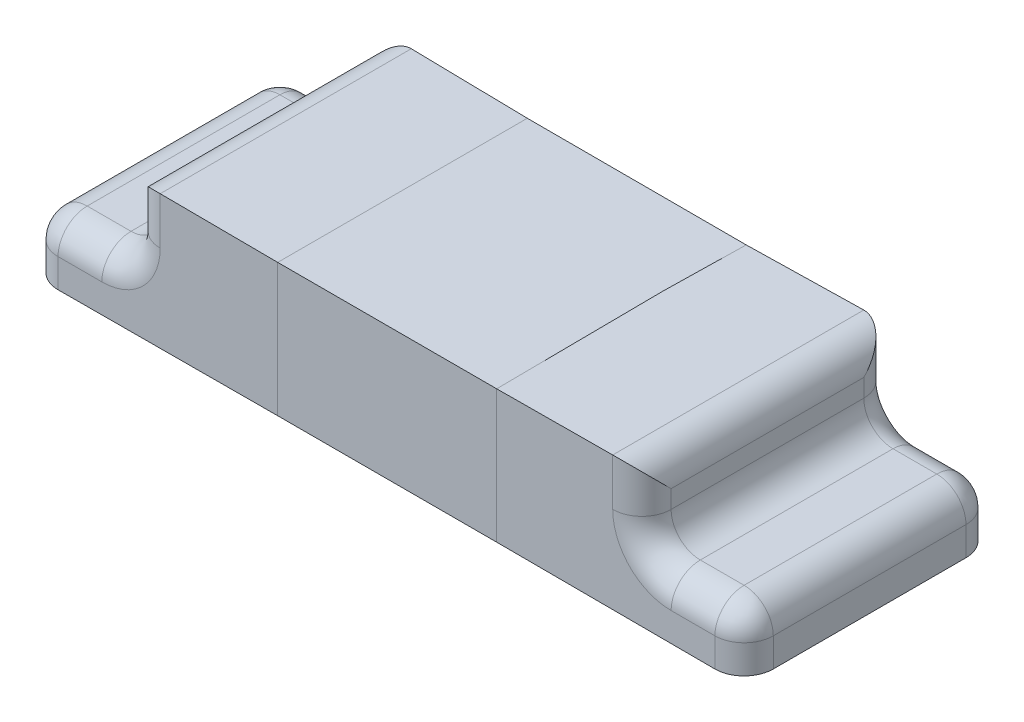
ISO-10303-21;
HEADER;
FILE_DESCRIPTION(('STEP AP214'),'2;1');
FILE_NAME('part.step','',(''),(''),'','','');
FILE_SCHEMA(('AUTOMOTIVE_DESIGN { 1 0 10303 214 1 1 1 1 }'));
ENDSEC;
DATA;
#1=APPLICATION_CONTEXT('core data for automotive mechanical design processes');
#2=APPLICATION_PROTOCOL_DEFINITION('international standard','automotive_design',2000,#1);
#3=PRODUCT_CONTEXT('',#1,'mechanical');
#4=PRODUCT('Part','Part','',(#3));
#5=PRODUCT_RELATED_PRODUCT_CATEGORY('part','',(#4));
#6=PRODUCT_DEFINITION_FORMATION('','',#4);
#7=PRODUCT_DEFINITION_CONTEXT('part definition',#1,'design');
#8=PRODUCT_DEFINITION('design','',#6,#7);
#9=PRODUCT_DEFINITION_SHAPE('','',#8);
#10=(LENGTH_UNIT() NAMED_UNIT(*) SI_UNIT(.MILLI.,.METRE.));
#11=(NAMED_UNIT(*) PLANE_ANGLE_UNIT() SI_UNIT($,.RADIAN.));
#12=(NAMED_UNIT(*) SI_UNIT($,.STERADIAN.) SOLID_ANGLE_UNIT());
#13=UNCERTAINTY_MEASURE_WITH_UNIT(LENGTH_MEASURE(1.E-05),#10,'distance_accuracy_value','');
#14=(GEOMETRIC_REPRESENTATION_CONTEXT(3) GLOBAL_UNCERTAINTY_ASSIGNED_CONTEXT((#13)) GLOBAL_UNIT_ASSIGNED_CONTEXT((#10,
#11,#12)) REPRESENTATION_CONTEXT('',''));
#15=CARTESIAN_POINT('',(0.,0.,0.));
#16=DIRECTION('',(0.,0.,1.));
#17=DIRECTION('',(1.,0.,0.));
#18=AXIS2_PLACEMENT_3D('',#15,#16,#17);
#19=CARTESIAN_POINT('',(-1.125,0.,0.33));
#20=DIRECTION('',(0.,1.,0.));
#21=DIRECTION('',(0.,0.,1.));
#22=AXIS2_PLACEMENT_3D('',#19,#20,#21);
#23=CYLINDRICAL_SURFACE('',#22,0.1);
#24=CARTESIAN_POINT('',(-1.125,0.098442990090282,0.33));
#25=DIRECTION('',(0.,-1.,0.));
#26=DIRECTION('',(0.,0.,-1.));
#27=AXIS2_PLACEMENT_3D('',#24,#25,#26);
#28=CIRCLE('',#27,0.1);
#29=CARTESIAN_POINT('',(-1.125,0.098442990090282,0.43));
#30=VERTEX_POINT('',#29);
#31=CARTESIAN_POINT('',(-1.225,0.098442990090282,0.33));
#32=VERTEX_POINT('',#31);
#33=EDGE_CURVE('E11',#30,#32,#28,.T.);
#34=ORIENTED_EDGE('',*,*,#33,.T.);
#35=DIRECTION('',(0.,1.,0.));
#36=VECTOR('',#35,1.);
#37=CARTESIAN_POINT('',(-1.225,0.098442990090282,0.33));
#38=LINE('',#37,#36);
#39=CARTESIAN_POINT('',(-1.225,0.,0.33));
#40=VERTEX_POINT('',#39);
#41=EDGE_CURVE('E441',#40,#32,#38,.T.);
#42=ORIENTED_EDGE('',*,*,#41,.F.);
#43=CARTESIAN_POINT('',(-1.125,0.,0.33));
#44=DIRECTION('',(0.,-1.,0.));
#45=DIRECTION('',(0.,0.,1.));
#46=AXIS2_PLACEMENT_3D('',#43,#44,#45);
#47=CIRCLE('',#46,0.1);
#48=CARTESIAN_POINT('',(-1.125,0.,0.43));
#49=VERTEX_POINT('',#48);
#50=EDGE_CURVE('E654',#49,#40,#47,.T.);
#51=ORIENTED_EDGE('',*,*,#50,.F.);
#52=DIRECTION('',(0.,-1.,0.));
#53=VECTOR('',#52,1.);
#54=CARTESIAN_POINT('',(-1.125,0.,0.43));
#55=LINE('',#54,#53);
#56=EDGE_CURVE('E501',#30,#49,#55,.T.);
#57=ORIENTED_EDGE('',*,*,#56,.F.);
#58=EDGE_LOOP('',(#34,#42,#51,#57));
#59=FACE_BOUND('',#58,.T.);
#60=ADVANCED_FACE('F18',(#59),#23,.T.);
#61=CARTESIAN_POINT('',(-1.125,0.098442990090282,0.33));
#62=DIRECTION('',(0.,1.,0.));
#63=DIRECTION('',(1.,0.,0.));
#64=AXIS2_PLACEMENT_3D('',#61,#62,#63);
#65=SPHERICAL_SURFACE('',#64,0.1);
#66=CARTESIAN_POINT('',(-1.125,0.098442990090282,0.33));
#67=DIRECTION('',(1.,0.,0.));
#68=DIRECTION('',(0.,0.,-1.));
#69=AXIS2_PLACEMENT_3D('',#66,#67,#68);
#70=CIRCLE('',#69,0.1);
#71=CARTESIAN_POINT('',(-1.125,0.198442990090282,0.33));
#72=VERTEX_POINT('',#71);
#73=EDGE_CURVE('E492',#72,#30,#70,.T.);
#74=ORIENTED_EDGE('',*,*,#73,.F.);
#75=CARTESIAN_POINT('',(-1.125,0.098442990090282,0.33));
#76=DIRECTION('',(0.,0.,-1.));
#77=DIRECTION('',(-1.,0.,0.));
#78=AXIS2_PLACEMENT_3D('',#75,#76,#77);
#79=CIRCLE('',#78,0.1);
#80=EDGE_CURVE('E419',#32,#72,#79,.T.);
#81=ORIENTED_EDGE('',*,*,#80,.F.);
#82=ORIENTED_EDGE('',*,*,#33,.F.);
#83=EDGE_LOOP('',(#74,#81,#82));
#84=FACE_BOUND('',#83,.T.);
#85=ADVANCED_FACE('F339',(#84),#65,.T.);
#86=CARTESIAN_POINT('',(-1.125,0.,-0.33));
#87=DIRECTION('',(0.,-1.,0.));
#88=DIRECTION('',(0.,0.,-1.));
#89=AXIS2_PLACEMENT_3D('',#86,#87,#88);
#90=CYLINDRICAL_SURFACE('',#89,0.1);
#91=CARTESIAN_POINT('',(-1.125,0.,-0.33));
#92=DIRECTION('',(0.,-1.,0.));
#93=DIRECTION('',(0.,0.,1.));
#94=AXIS2_PLACEMENT_3D('',#91,#92,#93);
#95=CIRCLE('',#94,0.1);
#96=CARTESIAN_POINT('',(-1.225,0.,-0.33));
#97=VERTEX_POINT('',#96);
#98=CARTESIAN_POINT('',(-1.125,0.,-0.43));
#99=VERTEX_POINT('',#98);
#100=EDGE_CURVE('E273',#97,#99,#95,.T.);
#101=ORIENTED_EDGE('',*,*,#100,.F.);
#102=DIRECTION('',(0.,-1.,0.));
#103=VECTOR('',#102,1.);
#104=CARTESIAN_POINT('',(-1.225,0.,-0.33));
#105=LINE('',#104,#103);
#106=CARTESIAN_POINT('',(-1.225,0.098442990090282,-0.33));
#107=VERTEX_POINT('',#106);
#108=EDGE_CURVE('E438',#107,#97,#105,.T.);
#109=ORIENTED_EDGE('',*,*,#108,.F.);
#110=CARTESIAN_POINT('',(-1.125,0.098442990090282,-0.33));
#111=DIRECTION('',(0.,-1.,0.));
#112=DIRECTION('',(0.,0.,-1.));
#113=AXIS2_PLACEMENT_3D('',#110,#111,#112);
#114=CIRCLE('',#113,0.1);
#115=CARTESIAN_POINT('',(-1.125,0.098442990090282,-0.43));
#116=VERTEX_POINT('',#115);
#117=EDGE_CURVE('E30',#107,#116,#114,.T.);
#118=ORIENTED_EDGE('',*,*,#117,.T.);
#119=DIRECTION('',(0.,1.,0.));
#120=VECTOR('',#119,1.);
#121=CARTESIAN_POINT('',(-1.125,0.098442990090282,-0.43));
#122=LINE('',#121,#120);
#123=EDGE_CURVE('E517',#99,#116,#122,.T.);
#124=ORIENTED_EDGE('',*,*,#123,.F.);
#125=EDGE_LOOP('',(#101,#109,#118,#124));
#126=FACE_BOUND('',#125,.T.);
#127=ADVANCED_FACE('F345',(#126),#90,.T.);
#128=CARTESIAN_POINT('',(-1.125,0.098442990090282,-0.33));
#129=DIRECTION('',(0.,1.,0.));
#130=DIRECTION('',(1.,0.,0.));
#131=AXIS2_PLACEMENT_3D('',#128,#129,#130);
#132=SPHERICAL_SURFACE('',#131,0.1);
#133=CARTESIAN_POINT('',(-1.125,0.098442990090282,-0.33));
#134=DIRECTION('',(0.,0.,1.));
#135=DIRECTION('',(-1.,0.,0.));
#136=AXIS2_PLACEMENT_3D('',#133,#134,#135);
#137=CIRCLE('',#136,0.1);
#138=CARTESIAN_POINT('',(-1.125,0.198442990090282,-0.33));
#139=VERTEX_POINT('',#138);
#140=EDGE_CURVE('E424',#139,#107,#137,.T.);
#141=ORIENTED_EDGE('',*,*,#140,.F.);
#142=CARTESIAN_POINT('',(-1.125,0.098442990090282,-0.33));
#143=DIRECTION('',(1.,0.,0.));
#144=DIRECTION('',(0.,0.,-1.));
#145=AXIS2_PLACEMENT_3D('',#142,#143,#144);
#146=CIRCLE('',#145,0.1);
#147=EDGE_CURVE('E542',#116,#139,#146,.T.);
#148=ORIENTED_EDGE('',*,*,#147,.F.);
#149=ORIENTED_EDGE('',*,*,#117,.F.);
#150=EDGE_LOOP('',(#141,#148,#149));
#151=FACE_BOUND('',#150,.T.);
#152=ADVANCED_FACE('F765',(#151),#132,.T.);
#153=CARTESIAN_POINT('',(-0.775,0.,-0.33));
#154=DIRECTION('',(0.,-1.,0.));
#155=DIRECTION('',(0.,0.,-1.));
#156=AXIS2_PLACEMENT_3D('',#153,#154,#155);
#157=CYLINDRICAL_SURFACE('',#156,0.1);
#158=CARTESIAN_POINT('',(-0.775,0.298442990090282,-0.33));
#159=DIRECTION('',(0.,1.,0.));
#160=DIRECTION('',(0.,0.,-1.));
#161=AXIS2_PLACEMENT_3D('',#158,#159,#160);
#162=CIRCLE('',#161,0.1);
#163=CARTESIAN_POINT('',(-0.775,0.298442990090282,-0.43));
#164=VERTEX_POINT('',#163);
#165=CARTESIAN_POINT('',(-0.875,0.298442990090282,-0.33));
#166=VERTEX_POINT('',#165);
#167=EDGE_CURVE('E431',#164,#166,#162,.T.);
#168=ORIENTED_EDGE('',*,*,#167,.T.);
#169=DIRECTION('',(0.,-1.,0.));
#170=VECTOR('',#169,1.);
#171=CARTESIAN_POINT('',(-0.875,0.198442990090282,-0.33));
#172=LINE('',#171,#170);
#173=CARTESIAN_POINT('',(-0.875,0.36,-0.33));
#174=VERTEX_POINT('',#173);
#175=EDGE_CURVE('E474',#174,#166,#172,.T.);
#176=ORIENTED_EDGE('',*,*,#175,.F.);
#177=CARTESIAN_POINT('',(-0.875,0.36,-0.33));
#178=CARTESIAN_POINT('',(-0.875000000000001,0.41857864376269,-0.388578643762691));
#179=CARTESIAN_POINT('',(-0.833578643762691,0.46,-0.43));
#180=CARTESIAN_POINT('',(-0.775,0.46,-0.43));
#181=(BOUNDED_CURVE() B_SPLINE_CURVE(3,(#177,#178,#179,#180),.UNSPECIFIED.,.F.,
.F.) B_SPLINE_CURVE_WITH_KNOTS((4,4),(4.71238898038469,6.28318530717958),
.UNSPECIFIED.) CURVE() GEOMETRIC_REPRESENTATION_ITEM() RATIONAL_B_SPLINE_CURVE((1.,
0.804737854124365,0.804737854124365,1.)) REPRESENTATION_ITEM(''));
#182=CARTESIAN_POINT('',(-0.775,0.46,-0.43));
#183=VERTEX_POINT('',#182);
#184=EDGE_CURVE('E425',#174,#183,#181,.T.);
#185=ORIENTED_EDGE('',*,*,#184,.T.);
#186=DIRECTION('',(0.,1.,0.));
#187=VECTOR('',#186,1.);
#188=CARTESIAN_POINT('',(-0.775,0.46,-0.43));
#189=LINE('',#188,#187);
#190=EDGE_CURVE('E468',#164,#183,#189,.T.);
#191=ORIENTED_EDGE('',*,*,#190,.F.);
#192=EDGE_LOOP('',(#168,#176,#185,#191));
#193=FACE_BOUND('',#192,.T.);
#194=ADVANCED_FACE('F768',(#193),#157,.T.);
#195=CARTESIAN_POINT('',(-0.775,0.36,0.43));
#196=DIRECTION('',(0.,0.,-1.));
#197=DIRECTION('',(-1.,0.,0.));
#198=AXIS2_PLACEMENT_3D('',#195,#196,#197);
#199=CYLINDRICAL_SURFACE('',#198,0.1);
#200=CARTESIAN_POINT('',(-0.875,0.36,0.33));
#201=CARTESIAN_POINT('',(-0.875000000000001,0.41857864376269,0.38857864376269));
#202=CARTESIAN_POINT('',(-0.833578643762691,0.46,0.43));
#203=CARTESIAN_POINT('',(-0.775,0.46,0.43));
#204=(BOUNDED_CURVE() B_SPLINE_CURVE(3,(#200,#201,#202,#203),.UNSPECIFIED.,.F.,
.F.) B_SPLINE_CURVE_WITH_KNOTS((4,4),(1.5707963267949,3.14159265358979),
.UNSPECIFIED.) CURVE() GEOMETRIC_REPRESENTATION_ITEM() RATIONAL_B_SPLINE_CURVE((1.,
0.804737854124365,0.804737854124365,1.)) REPRESENTATION_ITEM(''));
#205=CARTESIAN_POINT('',(-0.875,0.36,0.33));
#206=VERTEX_POINT('',#205);
#207=CARTESIAN_POINT('',(-0.775,0.46,0.43));
#208=VERTEX_POINT('',#207);
#209=EDGE_CURVE('E591',#206,#208,#204,.T.);
#210=ORIENTED_EDGE('',*,*,#209,.T.);
#211=DIRECTION('',(0.,0.,1.));
#212=VECTOR('',#211,1.);
#213=CARTESIAN_POINT('',(-0.775,0.46,0.43));
#214=LINE('',#213,#212);
#215=EDGE_CURVE('E522',#183,#208,#214,.T.);
#216=ORIENTED_EDGE('',*,*,#215,.F.);
#217=ORIENTED_EDGE('',*,*,#184,.F.);
#218=DIRECTION('',(0.,0.,-1.));
#219=VECTOR('',#218,1.);
#220=CARTESIAN_POINT('',(-0.875,0.36,-0.43));
#221=LINE('',#220,#219);
#222=EDGE_CURVE('E470',#206,#174,#221,.T.);
#223=ORIENTED_EDGE('',*,*,#222,.F.);
#224=EDGE_LOOP('',(#210,#216,#217,#223));
#225=FACE_BOUND('',#224,.T.);
#226=ADVANCED_FACE('F775',(#225),#199,.T.);
#227=CARTESIAN_POINT('',(-0.975,0.298442990090282,-0.33));
#228=DIRECTION('',(0.,0.,-1.));
#229=DIRECTION('',(-1.,0.,0.));
#230=AXIS2_PLACEMENT_3D('',#227,#228,#229);
#231=TOROIDAL_SURFACE('',#230,0.2,0.1);
#232=CARTESIAN_POINT('',(-0.975,0.098442990090282,-0.33));
#233=DIRECTION('',(1.,0.,0.));
#234=DIRECTION('',(0.,0.,-1.));
#235=AXIS2_PLACEMENT_3D('',#232,#233,#234);
#236=CIRCLE('',#235,0.1);
#237=CARTESIAN_POINT('',(-0.975,0.098442990090282,-0.43));
#238=VERTEX_POINT('',#237);
#239=CARTESIAN_POINT('',(-0.975,0.198442990090282,-0.33));
#240=VERTEX_POINT('',#239);
#241=EDGE_CURVE('E571',#238,#240,#236,.T.);
#242=ORIENTED_EDGE('',*,*,#241,.T.);
#243=CARTESIAN_POINT('',(-0.975,0.298442990090282,-0.33));
#244=DIRECTION('',(0.,0.,1.));
#245=DIRECTION('',(-1.,0.,0.));
#246=AXIS2_PLACEMENT_3D('',#243,#244,#245);
#247=CIRCLE('',#246,0.1);
#248=EDGE_CURVE('E452',#240,#166,#247,.T.);
#249=ORIENTED_EDGE('',*,*,#248,.T.);
#250=ORIENTED_EDGE('',*,*,#167,.F.);
#251=CARTESIAN_POINT('',(-0.975,0.298442990090282,-0.43));
#252=DIRECTION('',(0.,0.,-1.));
#253=DIRECTION('',(-1.,0.,0.));
#254=AXIS2_PLACEMENT_3D('',#251,#252,#253);
#255=CIRCLE('',#254,0.2);
#256=EDGE_CURVE('E464',#164,#238,#255,.T.);
#257=ORIENTED_EDGE('',*,*,#256,.T.);
#258=EDGE_LOOP('',(#242,#249,#250,#257));
#259=FACE_BOUND('',#258,.T.);
#260=ADVANCED_FACE('F1339',(#259),#231,.T.);
#261=CARTESIAN_POINT('',(-0.775,0.,0.33));
#262=DIRECTION('',(0.,1.,0.));
#263=DIRECTION('',(0.,0.,1.));
#264=AXIS2_PLACEMENT_3D('',#261,#262,#263);
#265=CYLINDRICAL_SURFACE('',#264,0.1);
#266=CARTESIAN_POINT('',(-0.775,0.298442990090282,0.33));
#267=DIRECTION('',(0.,1.,0.));
#268=DIRECTION('',(0.,0.,-1.));
#269=AXIS2_PLACEMENT_3D('',#266,#267,#268);
#270=CIRCLE('',#269,0.1);
#271=CARTESIAN_POINT('',(-0.875,0.298442990090282,0.33));
#272=VERTEX_POINT('',#271);
#273=CARTESIAN_POINT('',(-0.775,0.298442990090282,0.43));
#274=VERTEX_POINT('',#273);
#275=EDGE_CURVE('E423',#272,#274,#270,.T.);
#276=ORIENTED_EDGE('',*,*,#275,.T.);
#277=DIRECTION('',(0.,-1.,0.));
#278=VECTOR('',#277,1.);
#279=CARTESIAN_POINT('',(-0.775,0.198442990090282,0.43));
#280=LINE('',#279,#278);
#281=EDGE_CURVE('E523',#208,#274,#280,.T.);
#282=ORIENTED_EDGE('',*,*,#281,.F.);
#283=ORIENTED_EDGE('',*,*,#209,.F.);
#284=DIRECTION('',(0.,1.,0.));
#285=VECTOR('',#284,1.);
#286=CARTESIAN_POINT('',(-0.875,0.46,0.33));
#287=LINE('',#286,#285);
#288=EDGE_CURVE('E475',#272,#206,#287,.T.);
#289=ORIENTED_EDGE('',*,*,#288,.F.);
#290=EDGE_LOOP('',(#276,#282,#283,#289));
#291=FACE_BOUND('',#290,.T.);
#292=ADVANCED_FACE('F350',(#291),#265,.T.);
#293=CARTESIAN_POINT('',(-0.875,0.098442990090282,-0.33));
#294=DIRECTION('',(1.,0.,0.));
#295=DIRECTION('',(0.,0.,-1.));
#296=AXIS2_PLACEMENT_3D('',#293,#294,#295);
#297=CYLINDRICAL_SURFACE('',#296,0.1);
#298=DIRECTION('',(1.,0.,0.));
#299=VECTOR('',#298,1.);
#300=CARTESIAN_POINT('',(-0.875,0.098442990090282,-0.43));
#301=LINE('',#300,#299);
#302=EDGE_CURVE('E469',#116,#238,#301,.T.);
#303=ORIENTED_EDGE('',*,*,#302,.F.);
#304=ORIENTED_EDGE('',*,*,#147,.T.);
#305=DIRECTION('',(-1.,0.,0.));
#306=VECTOR('',#305,1.);
#307=CARTESIAN_POINT('',(-1.225,0.198442990090282,-0.33));
#308=LINE('',#307,#306);
#309=EDGE_CURVE('E538',#240,#139,#308,.T.);
#310=ORIENTED_EDGE('',*,*,#309,.F.);
#311=ORIENTED_EDGE('',*,*,#241,.F.);
#312=EDGE_LOOP('',(#303,#304,#310,#311));
#313=FACE_BOUND('',#312,.T.);
#314=ADVANCED_FACE('F1496',(#313),#297,.T.);
#315=CARTESIAN_POINT('',(-0.975,0.298442990090282,0.));
#316=DIRECTION('',(0.,0.,1.));
#317=DIRECTION('',(1.,0.,0.));
#318=AXIS2_PLACEMENT_3D('',#315,#316,#317);
#319=CYLINDRICAL_SURFACE('',#318,0.1);
#320=CARTESIAN_POINT('',(-0.975,0.298442990090282,0.33));
#321=DIRECTION('',(0.,0.,1.));
#322=DIRECTION('',(1.,0.,0.));
#323=AXIS2_PLACEMENT_3D('',#320,#321,#322);
#324=CIRCLE('',#323,0.1);
#325=CARTESIAN_POINT('',(-0.975,0.198442990090282,0.33));
#326=VERTEX_POINT('',#325);
#327=EDGE_CURVE('E449',#326,#272,#324,.T.);
#328=ORIENTED_EDGE('',*,*,#327,.T.);
#329=DIRECTION('',(0.,0.,1.));
#330=VECTOR('',#329,1.);
#331=CARTESIAN_POINT('',(-0.875,0.298442990090282,0.));
#332=LINE('',#331,#330);
#333=EDGE_CURVE('E448',#166,#272,#332,.T.);
#334=ORIENTED_EDGE('',*,*,#333,.F.);
#335=ORIENTED_EDGE('',*,*,#248,.F.);
#336=DIRECTION('',(0.,0.,-1.));
#337=VECTOR('',#336,1.);
#338=CARTESIAN_POINT('',(-0.975,0.198442990090282,0.43));
#339=LINE('',#338,#337);
#340=EDGE_CURVE('E447',#326,#240,#339,.T.);
#341=ORIENTED_EDGE('',*,*,#340,.F.);
#342=EDGE_LOOP('',(#328,#334,#335,#341));
#343=FACE_BOUND('',#342,.T.);
#344=ADVANCED_FACE('F20',(#343),#319,.F.);
#345=CARTESIAN_POINT('',(-0.975,0.298442990090282,0.33));
#346=DIRECTION('',(0.,0.,1.));
#347=DIRECTION('',(1.,0.,0.));
#348=AXIS2_PLACEMENT_3D('',#345,#346,#347);
#349=TOROIDAL_SURFACE('',#348,0.2,0.1);
#350=ORIENTED_EDGE('',*,*,#275,.F.);
#351=ORIENTED_EDGE('',*,*,#327,.F.);
#352=CARTESIAN_POINT('',(-0.975,0.098442990090282,0.33));
#353=DIRECTION('',(1.,0.,0.));
#354=DIRECTION('',(0.,0.,-1.));
#355=AXIS2_PLACEMENT_3D('',#352,#353,#354);
#356=CIRCLE('',#355,0.1);
#357=CARTESIAN_POINT('',(-0.975,0.098442990090282,0.43));
#358=VERTEX_POINT('',#357);
#359=EDGE_CURVE('E495',#326,#358,#356,.T.);
#360=ORIENTED_EDGE('',*,*,#359,.T.);
#361=CARTESIAN_POINT('',(-0.975,0.298442990090282,0.43));
#362=DIRECTION('',(0.,0.,1.));
#363=DIRECTION('',(1.,0.,0.));
#364=AXIS2_PLACEMENT_3D('',#361,#362,#363);
#365=CIRCLE('',#364,0.2);
#366=EDGE_CURVE('E518',#358,#274,#365,.T.);
#367=ORIENTED_EDGE('',*,*,#366,.T.);
#368=EDGE_LOOP('',(#350,#351,#360,#367));
#369=FACE_BOUND('',#368,.T.);
#370=ADVANCED_FACE('F780',(#369),#349,.T.);
#371=CARTESIAN_POINT('',(-1.125,0.098442990090282,0.43));
#372=DIRECTION('',(0.,0.,-1.));
#373=DIRECTION('',(-1.,0.,0.));
#374=AXIS2_PLACEMENT_3D('',#371,#372,#373);
#375=CYLINDRICAL_SURFACE('',#374,0.1);
#376=DIRECTION('',(0.,0.,1.));
#377=VECTOR('',#376,1.);
#378=CARTESIAN_POINT('',(-1.125,0.198442990090282,0.43));
#379=LINE('',#378,#377);
#380=EDGE_CURVE('E534',#139,#72,#379,.T.);
#381=ORIENTED_EDGE('',*,*,#380,.F.);
#382=ORIENTED_EDGE('',*,*,#140,.T.);
#383=DIRECTION('',(0.,0.,-1.));
#384=VECTOR('',#383,1.);
#385=CARTESIAN_POINT('',(-1.225,0.098442990090282,-0.43));
#386=LINE('',#385,#384);
#387=EDGE_CURVE('E442',#32,#107,#386,.T.);
#388=ORIENTED_EDGE('',*,*,#387,.F.);
#389=ORIENTED_EDGE('',*,*,#80,.T.);
#390=EDGE_LOOP('',(#381,#382,#388,#389));
#391=FACE_BOUND('',#390,.T.);
#392=ADVANCED_FACE('F782',(#391),#375,.T.);
#393=CARTESIAN_POINT('',(-1.225,0.098442990090282,0.33));
#394=DIRECTION('',(1.,0.,0.));
#395=DIRECTION('',(0.,0.,-1.));
#396=AXIS2_PLACEMENT_3D('',#393,#394,#395);
#397=CYLINDRICAL_SURFACE('',#396,0.1);
#398=DIRECTION('',(1.,0.,0.));
#399=VECTOR('',#398,1.);
#400=CARTESIAN_POINT('',(-1.225,0.198442990090282,0.33));
#401=LINE('',#400,#399);
#402=EDGE_CURVE('E443',#72,#326,#401,.T.);
#403=ORIENTED_EDGE('',*,*,#402,.F.);
#404=ORIENTED_EDGE('',*,*,#73,.T.);
#405=DIRECTION('',(-1.,0.,0.));
#406=VECTOR('',#405,1.);
#407=CARTESIAN_POINT('',(-0.875,0.098442990090282,0.43));
#408=LINE('',#407,#406);
#409=EDGE_CURVE('E497',#358,#30,#408,.T.);
#410=ORIENTED_EDGE('',*,*,#409,.F.);
#411=ORIENTED_EDGE('',*,*,#359,.F.);
#412=EDGE_LOOP('',(#403,#404,#410,#411));
#413=FACE_BOUND('',#412,.T.);
#414=ADVANCED_FACE('F1367',(#413),#397,.T.);
#415=CARTESIAN_POINT('',(-1.225,0.,0.));
#416=DIRECTION('',(1.,0.,0.));
#417=DIRECTION('',(0.,1.,0.));
#418=AXIS2_PLACEMENT_3D('',#415,#416,#417);
#419=PLANE('',#418);
#420=ORIENTED_EDGE('',*,*,#387,.T.);
#421=ORIENTED_EDGE('',*,*,#108,.T.);
#422=DIRECTION('',(0.,0.,-1.));
#423=VECTOR('',#422,1.);
#424=CARTESIAN_POINT('',(-1.225,0.,0.43));
#425=LINE('',#424,#423);
#426=EDGE_CURVE('E437',#40,#97,#425,.T.);
#427=ORIENTED_EDGE('',*,*,#426,.F.);
#428=ORIENTED_EDGE('',*,*,#41,.T.);
#429=EDGE_LOOP('',(#420,#421,#427,#428));
#430=FACE_BOUND('',#429,.T.);
#431=ADVANCED_FACE('F1306',(#430),#419,.F.);
#432=CARTESIAN_POINT('',(-1.225,0.198442990090282,0.43));
#433=DIRECTION('',(0.,1.,0.));
#434=DIRECTION('',(1.,0.,0.));
#435=AXIS2_PLACEMENT_3D('',#432,#433,#434);
#436=PLANE('',#435);
#437=ORIENTED_EDGE('',*,*,#402,.T.);
#438=ORIENTED_EDGE('',*,*,#340,.T.);
#439=ORIENTED_EDGE('',*,*,#309,.T.);
#440=ORIENTED_EDGE('',*,*,#380,.T.);
#441=EDGE_LOOP('',(#437,#438,#439,#440));
#442=FACE_BOUND('',#441,.T.);
#443=ADVANCED_FACE('F1302',(#442),#436,.T.);
#444=CARTESIAN_POINT('',(-0.875,0.,0.));
#445=DIRECTION('',(1.,0.,0.));
#446=DIRECTION('',(0.,1.,0.));
#447=AXIS2_PLACEMENT_3D('',#444,#445,#446);
#448=PLANE('',#447);
#449=ORIENTED_EDGE('',*,*,#288,.T.);
#450=ORIENTED_EDGE('',*,*,#222,.T.);
#451=ORIENTED_EDGE('',*,*,#175,.T.);
#452=ORIENTED_EDGE('',*,*,#333,.T.);
#453=EDGE_LOOP('',(#449,#450,#451,#452));
#454=FACE_BOUND('',#453,.T.);
#455=ADVANCED_FACE('F1271',(#454),#448,.F.);
#456=CARTESIAN_POINT('',(-0.875,0.46,0.43));
#457=DIRECTION('',(0.,1.,0.));
#458=DIRECTION('',(1.,0.,0.));
#459=AXIS2_PLACEMENT_3D('',#456,#457,#458);
#460=PLANE('',#459);
#461=DIRECTION('',(1.,0.,0.));
#462=VECTOR('',#461,1.);
#463=CARTESIAN_POINT('',(-0.875,0.46,-0.43));
#464=LINE('',#463,#462);
#465=CARTESIAN_POINT('',(-0.375,0.455,-0.4275));
#466=VERTEX_POINT('',#465);
#467=EDGE_CURVE('E382',#183,#466,#464,.T.);
#468=ORIENTED_EDGE('',*,*,#467,.F.);
#469=ORIENTED_EDGE('',*,*,#215,.T.);
#470=DIRECTION('',(1.,0.,0.));
#471=VECTOR('',#470,1.);
#472=CARTESIAN_POINT('',(-0.875,0.46,0.43));
#473=LINE('',#472,#471);
#474=CARTESIAN_POINT('',(-0.375,0.455,0.4275));
#475=VERTEX_POINT('',#474);
#476=EDGE_CURVE('E563',#208,#475,#473,.T.);
#477=ORIENTED_EDGE('',*,*,#476,.T.);
#478=CARTESIAN_POINT('',(-0.375,0.45,-0.4275));
#479=DIRECTION('',(0.,0.,1.));
#480=VECTOR('',#479,1.);
#481=LINE('',#478,#480);
#482=EDGE_CURVE('E283',#466,#475,#481,.T.);
#483=ORIENTED_EDGE('',*,*,#482,.F.);
#484=EDGE_LOOP('',(#468,#469,#477,#483));
#485=FACE_BOUND('',#484,.T.);
#486=ADVANCED_FACE('F334',(#485),#460,.T.);
#487=CARTESIAN_POINT('',(-0.875,0.,0.43));
#488=DIRECTION('',(0.,0.,1.));
#489=DIRECTION('',(1.,0.,0.));
#490=AXIS2_PLACEMENT_3D('',#487,#488,#489);
#491=PLANE('',#490);
#492=ORIENTED_EDGE('',*,*,#409,.T.);
#493=ORIENTED_EDGE('',*,*,#56,.T.);
#494=DIRECTION('',(1.,0.,0.));
#495=VECTOR('',#494,1.);
#496=CARTESIAN_POINT('',(-0.875,0.,0.43));
#497=LINE('',#496,#495);
#498=CARTESIAN_POINT('',(-0.375,0.,0.4275));
#499=VERTEX_POINT('',#498);
#500=EDGE_CURVE('E651',#49,#499,#497,.T.);
#501=ORIENTED_EDGE('',*,*,#500,.T.);
#502=CARTESIAN_POINT('',(-0.375,0.455,0.425));
#503=DIRECTION('',(0.,-1.,0.));
#504=VECTOR('',#503,1.);
#505=LINE('',#502,#504);
#506=EDGE_CURVE('E643',#475,#499,#505,.T.);
#507=ORIENTED_EDGE('',*,*,#506,.F.);
#508=ORIENTED_EDGE('',*,*,#476,.F.);
#509=ORIENTED_EDGE('',*,*,#281,.T.);
#510=ORIENTED_EDGE('',*,*,#366,.F.);
#511=EDGE_LOOP('',(#492,#493,#501,#507,#508,#509,#510));
#512=FACE_BOUND('',#511,.T.);
#513=ADVANCED_FACE('F328',(#512),#491,.T.);
#514=CARTESIAN_POINT('',(-0.875,0.,-0.43));
#515=DIRECTION('',(0.,0.,-1.));
#516=DIRECTION('',(0.,-1.,0.));
#517=AXIS2_PLACEMENT_3D('',#514,#515,#516);
#518=PLANE('',#517);
#519=DIRECTION('',(1.,0.,0.));
#520=VECTOR('',#519,1.);
#521=CARTESIAN_POINT('',(-0.875,0.,-0.43));
#522=LINE('',#521,#520);
#523=CARTESIAN_POINT('',(-0.375,0.,-0.4275));
#524=VERTEX_POINT('',#523);
#525=EDGE_CURVE('E267',#99,#524,#522,.T.);
#526=ORIENTED_EDGE('',*,*,#525,.F.);
#527=ORIENTED_EDGE('',*,*,#123,.T.);
#528=ORIENTED_EDGE('',*,*,#302,.T.);
#529=ORIENTED_EDGE('',*,*,#256,.F.);
#530=ORIENTED_EDGE('',*,*,#190,.T.);
#531=ORIENTED_EDGE('',*,*,#467,.T.);
#532=CARTESIAN_POINT('',(-0.375,0.,-0.425));
#533=DIRECTION('',(0.,1.,0.));
#534=VECTOR('',#533,1.);
#535=LINE('',#532,#534);
#536=EDGE_CURVE('E377',#524,#466,#535,.T.);
#537=ORIENTED_EDGE('',*,*,#536,.F.);
#538=EDGE_LOOP('',(#526,#527,#528,#529,#530,#531,#537));
#539=FACE_BOUND('',#538,.T.);
#540=ADVANCED_FACE('F319',(#539),#518,.T.);
#541=CARTESIAN_POINT('',(1.125,0.,0.33));
#542=DIRECTION('',(0.,-1.,0.));
#543=DIRECTION('',(0.,0.,-1.));
#544=AXIS2_PLACEMENT_3D('',#541,#542,#543);
#545=CYLINDRICAL_SURFACE('',#544,0.1);
#546=CARTESIAN_POINT('',(1.125,0.098442990090282,0.33));
#547=DIRECTION('',(0.,-1.,0.));
#548=DIRECTION('',(0.,0.,-1.));
#549=AXIS2_PLACEMENT_3D('',#546,#547,#548);
#550=CIRCLE('',#549,0.1);
#551=CARTESIAN_POINT('',(1.225,0.098442990090282,0.33));
#552=VERTEX_POINT('',#551);
#553=CARTESIAN_POINT('',(1.125,0.098442990090282,0.43));
#554=VERTEX_POINT('',#553);
#555=EDGE_CURVE('E487',#552,#554,#550,.T.);
#556=ORIENTED_EDGE('',*,*,#555,.T.);
#557=DIRECTION('',(0.,1.,0.));
#558=VECTOR('',#557,1.);
#559=CARTESIAN_POINT('',(1.125,0.,0.43));
#560=LINE('',#559,#558);
#561=CARTESIAN_POINT('',(1.125,0.,0.43));
#562=VERTEX_POINT('',#561);
#563=EDGE_CURVE('E453',#562,#554,#560,.T.);
#564=ORIENTED_EDGE('',*,*,#563,.F.);
#565=CARTESIAN_POINT('',(1.125,0.,0.33));
#566=DIRECTION('',(0.,-1.,0.));
#567=DIRECTION('',(0.,0.,1.));
#568=AXIS2_PLACEMENT_3D('',#565,#566,#567);
#569=CIRCLE('',#568,0.1);
#570=CARTESIAN_POINT('',(1.225,0.,0.33));
#571=VERTEX_POINT('',#570);
#572=EDGE_CURVE('E545',#571,#562,#569,.T.);
#573=ORIENTED_EDGE('',*,*,#572,.F.);
#574=DIRECTION('',(0.,-1.,0.));
#575=VECTOR('',#574,1.);
#576=CARTESIAN_POINT('',(1.225,0.,0.33));
#577=LINE('',#576,#575);
#578=EDGE_CURVE('E550',#552,#571,#577,.T.);
#579=ORIENTED_EDGE('',*,*,#578,.F.);
#580=EDGE_LOOP('',(#556,#564,#573,#579));
#581=FACE_BOUND('',#580,.T.);
#582=ADVANCED_FACE('F315',(#581),#545,.T.);
#583=CARTESIAN_POINT('',(1.125,0.098442990090282,0.33));
#584=DIRECTION('',(0.,1.,0.));
#585=DIRECTION('',(1.,0.,0.));
#586=AXIS2_PLACEMENT_3D('',#583,#584,#585);
#587=SPHERICAL_SURFACE('',#586,0.1);
#588=CARTESIAN_POINT('',(1.125,0.098442990090282,0.33));
#589=DIRECTION('',(0.,0.,-1.));
#590=DIRECTION('',(1.,0.,0.));
#591=AXIS2_PLACEMENT_3D('',#588,#589,#590);
#592=CIRCLE('',#591,0.1);
#593=CARTESIAN_POINT('',(1.125,0.198442990090282,0.33));
#594=VERTEX_POINT('',#593);
#595=EDGE_CURVE('E480',#594,#552,#592,.T.);
#596=ORIENTED_EDGE('',*,*,#595,.F.);
#597=CARTESIAN_POINT('',(1.125,0.098442990090282,0.33));
#598=DIRECTION('',(-1.,0.,0.));
#599=DIRECTION('',(0.,0.,1.));
#600=AXIS2_PLACEMENT_3D('',#597,#598,#599);
#601=CIRCLE('',#600,0.1);
#602=EDGE_CURVE('E553',#554,#594,#601,.T.);
#603=ORIENTED_EDGE('',*,*,#602,.F.);
#604=ORIENTED_EDGE('',*,*,#555,.F.);
#605=EDGE_LOOP('',(#596,#603,#604));
#606=FACE_BOUND('',#605,.T.);
#607=ADVANCED_FACE('F318',(#606),#587,.T.);
#608=CARTESIAN_POINT('',(1.125,0.,-0.33));
#609=DIRECTION('',(0.,1.,0.));
#610=DIRECTION('',(0.,0.,1.));
#611=AXIS2_PLACEMENT_3D('',#608,#609,#610);
#612=CYLINDRICAL_SURFACE('',#611,0.1);
#613=CARTESIAN_POINT('',(1.125,0.,-0.33));
#614=DIRECTION('',(0.,-1.,0.));
#615=DIRECTION('',(0.,0.,1.));
#616=AXIS2_PLACEMENT_3D('',#613,#614,#615);
#617=CIRCLE('',#616,0.1);
#618=CARTESIAN_POINT('',(1.125,0.,-0.43));
#619=VERTEX_POINT('',#618);
#620=CARTESIAN_POINT('',(1.225,0.,-0.33));
#621=VERTEX_POINT('',#620);
#622=EDGE_CURVE('E251',#619,#621,#617,.T.);
#623=ORIENTED_EDGE('',*,*,#622,.F.);
#624=DIRECTION('',(0.,-1.,0.));
#625=VECTOR('',#624,1.);
#626=CARTESIAN_POINT('',(1.125,0.,-0.43));
#627=LINE('',#626,#625);
#628=CARTESIAN_POINT('',(1.125,0.098442990090282,-0.43));
#629=VERTEX_POINT('',#628);
#630=EDGE_CURVE('E236',#629,#619,#627,.T.);
#631=ORIENTED_EDGE('',*,*,#630,.F.);
#632=CARTESIAN_POINT('',(1.125,0.098442990090282,-0.33));
#633=DIRECTION('',(0.,-1.,0.));
#634=DIRECTION('',(0.,0.,-1.));
#635=AXIS2_PLACEMENT_3D('',#632,#633,#634);
#636=CIRCLE('',#635,0.1);
#637=CARTESIAN_POINT('',(1.225,0.098442990090282,-0.33));
#638=VERTEX_POINT('',#637);
#639=EDGE_CURVE('E484',#629,#638,#636,.T.);
#640=ORIENTED_EDGE('',*,*,#639,.T.);
#641=DIRECTION('',(0.,1.,0.));
#642=VECTOR('',#641,1.);
#643=CARTESIAN_POINT('',(1.225,0.,-0.33));
#644=LINE('',#643,#642);
#645=EDGE_CURVE('E254',#621,#638,#644,.T.);
#646=ORIENTED_EDGE('',*,*,#645,.F.);
#647=EDGE_LOOP('',(#623,#631,#640,#646));
#648=FACE_BOUND('',#647,.T.);
#649=ADVANCED_FACE('F252',(#648),#612,.T.);
#650=CARTESIAN_POINT('',(1.125,0.098442990090282,-0.33));
#651=DIRECTION('',(0.,1.,0.));
#652=DIRECTION('',(1.,0.,0.));
#653=AXIS2_PLACEMENT_3D('',#650,#651,#652);
#654=SPHERICAL_SURFACE('',#653,0.1);
#655=CARTESIAN_POINT('',(1.125,0.098442990090282,-0.33));
#656=DIRECTION('',(-1.,0.,0.));
#657=DIRECTION('',(0.,0.,1.));
#658=AXIS2_PLACEMENT_3D('',#655,#656,#657);
#659=CIRCLE('',#658,0.1);
#660=CARTESIAN_POINT('',(1.125,0.198442990090282,-0.33));
#661=VERTEX_POINT('',#660);
#662=EDGE_CURVE('E409',#661,#629,#659,.T.);
#663=ORIENTED_EDGE('',*,*,#662,.F.);
#664=CARTESIAN_POINT('',(1.125,0.098442990090282,-0.33));
#665=DIRECTION('',(0.,0.,1.));
#666=DIRECTION('',(1.,0.,0.));
#667=AXIS2_PLACEMENT_3D('',#664,#665,#666);
#668=CIRCLE('',#667,0.1);
#669=EDGE_CURVE('E476',#638,#661,#668,.T.);
#670=ORIENTED_EDGE('',*,*,#669,.F.);
#671=ORIENTED_EDGE('',*,*,#639,.F.);
#672=EDGE_LOOP('',(#663,#670,#671));
#673=FACE_BOUND('',#672,.T.);
#674=ADVANCED_FACE('F750',(#673),#654,.T.);
#675=CARTESIAN_POINT('',(0.775,0.,-0.33));
#676=DIRECTION('',(0.,1.,0.));
#677=DIRECTION('',(0.,0.,1.));
#678=AXIS2_PLACEMENT_3D('',#675,#676,#677);
#679=CYLINDRICAL_SURFACE('',#678,0.1);
#680=CARTESIAN_POINT('',(0.775,0.298442990090282,-0.33));
#681=DIRECTION('',(0.,1.,0.));
#682=DIRECTION('',(0.,0.,-1.));
#683=AXIS2_PLACEMENT_3D('',#680,#681,#682);
#684=CIRCLE('',#683,0.1);
#685=CARTESIAN_POINT('',(0.875,0.298442990090282,-0.33));
#686=VERTEX_POINT('',#685);
#687=CARTESIAN_POINT('',(0.775,0.298442990090282,-0.43));
#688=VERTEX_POINT('',#687);
#689=EDGE_CURVE('E597',#686,#688,#684,.T.);
#690=ORIENTED_EDGE('',*,*,#689,.T.);
#691=DIRECTION('',(0.,-1.,0.));
#692=VECTOR('',#691,1.);
#693=CARTESIAN_POINT('',(0.775,0.,-0.43));
#694=LINE('',#693,#692);
#695=CARTESIAN_POINT('',(0.775,0.46,-0.43));
#696=VERTEX_POINT('',#695);
#697=EDGE_CURVE('E581',#696,#688,#694,.T.);
#698=ORIENTED_EDGE('',*,*,#697,.F.);
#699=CARTESIAN_POINT('',(0.775,0.46,-0.43));
#700=CARTESIAN_POINT('',(0.833578643762691,0.46,-0.43));
#701=CARTESIAN_POINT('',(0.875000000000001,0.41857864376269,-0.38857864376269));
#702=CARTESIAN_POINT('',(0.875,0.36,-0.33));
#703=(BOUNDED_CURVE() B_SPLINE_CURVE(3,(#699,#700,#701,#702),.UNSPECIFIED.,.F.,
.F.) B_SPLINE_CURVE_WITH_KNOTS((4,4),(3.1415926535898,4.71238898038469),
.UNSPECIFIED.) CURVE() GEOMETRIC_REPRESENTATION_ITEM() RATIONAL_B_SPLINE_CURVE((1.,
0.804737854124365,0.804737854124365,1.)) REPRESENTATION_ITEM(''));
#704=CARTESIAN_POINT('',(0.875,0.36,-0.33));
#705=VERTEX_POINT('',#704);
#706=EDGE_CURVE('E488',#696,#705,#703,.T.);
#707=ORIENTED_EDGE('',*,*,#706,.T.);
#708=DIRECTION('',(0.,1.,0.));
#709=VECTOR('',#708,1.);
#710=CARTESIAN_POINT('',(0.875,0.,-0.33));
#711=LINE('',#710,#709);
#712=EDGE_CURVE('E512',#686,#705,#711,.T.);
#713=ORIENTED_EDGE('',*,*,#712,.F.);
#714=EDGE_LOOP('',(#690,#698,#707,#713));
#715=FACE_BOUND('',#714,.T.);
#716=ADVANCED_FACE('F733',(#715),#679,.T.);
#717=CARTESIAN_POINT('',(0.775,0.36,0.));
#718=DIRECTION('',(0.,0.,1.));
#719=DIRECTION('',(1.,0.,0.));
#720=AXIS2_PLACEMENT_3D('',#717,#718,#719);
#721=CYLINDRICAL_SURFACE('',#720,0.1);
#722=CARTESIAN_POINT('',(0.775,0.46,0.43));
#723=CARTESIAN_POINT('',(0.833578643762691,0.46,0.43));
#724=CARTESIAN_POINT('',(0.875000000000001,0.41857864376269,0.38857864376269));
#725=CARTESIAN_POINT('',(0.875,0.36,0.33));
#726=(BOUNDED_CURVE() B_SPLINE_CURVE(3,(#722,#723,#724,#725),.UNSPECIFIED.,.F.,
.F.) B_SPLINE_CURVE_WITH_KNOTS((4,4),(0.,1.5707963267949),
.UNSPECIFIED.) CURVE() GEOMETRIC_REPRESENTATION_ITEM() RATIONAL_B_SPLINE_CURVE((1.,
0.804737854124365,0.804737854124365,1.)) REPRESENTATION_ITEM(''));
#727=CARTESIAN_POINT('',(0.775,0.46,0.43));
#728=VERTEX_POINT('',#727);
#729=CARTESIAN_POINT('',(0.875,0.36,0.33));
#730=VERTEX_POINT('',#729);
#731=EDGE_CURVE('E603',#728,#730,#726,.T.);
#732=ORIENTED_EDGE('',*,*,#731,.T.);
#733=DIRECTION('',(0.,0.,1.));
#734=VECTOR('',#733,1.);
#735=CARTESIAN_POINT('',(0.875,0.36,0.));
#736=LINE('',#735,#734);
#737=EDGE_CURVE('E405',#705,#730,#736,.T.);
#738=ORIENTED_EDGE('',*,*,#737,.F.);
#739=ORIENTED_EDGE('',*,*,#706,.F.);
#740=DIRECTION('',(0.,0.,-1.));
#741=VECTOR('',#740,1.);
#742=CARTESIAN_POINT('',(0.775,0.46,0.43));
#743=LINE('',#742,#741);
#744=EDGE_CURVE('E507',#728,#696,#743,.T.);
#745=ORIENTED_EDGE('',*,*,#744,.F.);
#746=EDGE_LOOP('',(#732,#738,#739,#745));
#747=FACE_BOUND('',#746,.T.);
#748=ADVANCED_FACE('F757',(#747),#721,.T.);
#749=CARTESIAN_POINT('',(0.975,0.298442990090282,-0.33));
#750=DIRECTION('',(0.,0.,1.));
#751=DIRECTION('',(1.,0.,0.));
#752=AXIS2_PLACEMENT_3D('',#749,#750,#751);
#753=TOROIDAL_SURFACE('',#752,0.2,0.1);
#754=CARTESIAN_POINT('',(0.975,0.098442990090282,-0.33));
#755=DIRECTION('',(-1.,0.,0.));
#756=DIRECTION('',(0.,0.,1.));
#757=AXIS2_PLACEMENT_3D('',#754,#755,#756);
#758=CIRCLE('',#757,0.1);
#759=CARTESIAN_POINT('',(0.975,0.198442990090282,-0.33));
#760=VERTEX_POINT('',#759);
#761=CARTESIAN_POINT('',(0.975,0.098442990090282,-0.43));
#762=VERTEX_POINT('',#761);
#763=EDGE_CURVE('E413',#760,#762,#758,.T.);
#764=ORIENTED_EDGE('',*,*,#763,.T.);
#765=CARTESIAN_POINT('',(0.975,0.298442990090282,-0.43));
#766=DIRECTION('',(0.,0.,-1.));
#767=DIRECTION('',(1.,0.,0.));
#768=AXIS2_PLACEMENT_3D('',#765,#766,#767);
#769=CIRCLE('',#768,0.2);
#770=EDGE_CURVE('E577',#762,#688,#769,.T.);
#771=ORIENTED_EDGE('',*,*,#770,.T.);
#772=ORIENTED_EDGE('',*,*,#689,.F.);
#773=CARTESIAN_POINT('',(0.975,0.298442990090282,-0.33));
#774=DIRECTION('',(0.,0.,1.));
#775=DIRECTION('',(1.,0.,0.));
#776=AXIS2_PLACEMENT_3D('',#773,#774,#775);
#777=CIRCLE('',#776,0.1);
#778=EDGE_CURVE('E608',#686,#760,#777,.T.);
#779=ORIENTED_EDGE('',*,*,#778,.T.);
#780=EDGE_LOOP('',(#764,#771,#772,#779));
#781=FACE_BOUND('',#780,.T.);
#782=ADVANCED_FACE('F738',(#781),#753,.T.);
#783=CARTESIAN_POINT('',(0.775,0.,0.33));
#784=DIRECTION('',(0.,-1.,0.));
#785=DIRECTION('',(0.,0.,-1.));
#786=AXIS2_PLACEMENT_3D('',#783,#784,#785);
#787=CYLINDRICAL_SURFACE('',#786,0.1);
#788=CARTESIAN_POINT('',(0.775,0.298442990090282,0.33));
#789=DIRECTION('',(0.,1.,0.));
#790=DIRECTION('',(0.,0.,-1.));
#791=AXIS2_PLACEMENT_3D('',#788,#789,#790);
#792=CIRCLE('',#791,0.1);
#793=CARTESIAN_POINT('',(0.775,0.298442990090282,0.43));
#794=VERTEX_POINT('',#793);
#795=CARTESIAN_POINT('',(0.875,0.298442990090282,0.33));
#796=VERTEX_POINT('',#795);
#797=EDGE_CURVE('E124',#794,#796,#792,.T.);
#798=ORIENTED_EDGE('',*,*,#797,.T.);
#799=DIRECTION('',(0.,-1.,0.));
#800=VECTOR('',#799,1.);
#801=CARTESIAN_POINT('',(0.875,0.,0.33));
#802=LINE('',#801,#800);
#803=EDGE_CURVE('E395',#730,#796,#802,.T.);
#804=ORIENTED_EDGE('',*,*,#803,.F.);
#805=ORIENTED_EDGE('',*,*,#731,.F.);
#806=DIRECTION('',(0.,1.,0.));
#807=VECTOR('',#806,1.);
#808=CARTESIAN_POINT('',(0.775,0.,0.43));
#809=LINE('',#808,#807);
#810=EDGE_CURVE('E530',#794,#728,#809,.T.);
#811=ORIENTED_EDGE('',*,*,#810,.F.);
#812=EDGE_LOOP('',(#798,#804,#805,#811));
#813=FACE_BOUND('',#812,.T.);
#814=ADVANCED_FACE('F324',(#813),#787,.T.);
#815=CARTESIAN_POINT('',(0.975,0.298442990090282,0.43));
#816=DIRECTION('',(0.,0.,-1.));
#817=DIRECTION('',(-1.,0.,0.));
#818=AXIS2_PLACEMENT_3D('',#815,#816,#817);
#819=CYLINDRICAL_SURFACE('',#818,0.1);
#820=CARTESIAN_POINT('',(0.975,0.298442990090282,0.33));
#821=DIRECTION('',(0.,0.,1.));
#822=DIRECTION('',(-1.,0.,0.));
#823=AXIS2_PLACEMENT_3D('',#820,#821,#822);
#824=CIRCLE('',#823,0.1);
#825=CARTESIAN_POINT('',(0.975,0.198442990090282,0.33));
#826=VERTEX_POINT('',#825);
#827=EDGE_CURVE('E483',#796,#826,#824,.T.);
#828=ORIENTED_EDGE('',*,*,#827,.T.);
#829=DIRECTION('',(0.,0.,1.));
#830=VECTOR('',#829,1.);
#831=CARTESIAN_POINT('',(0.975,0.198442990090282,0.43));
#832=LINE('',#831,#830);
#833=EDGE_CURVE('E459',#760,#826,#832,.T.);
#834=ORIENTED_EDGE('',*,*,#833,.F.);
#835=ORIENTED_EDGE('',*,*,#778,.F.);
#836=DIRECTION('',(0.,0.,-1.));
#837=VECTOR('',#836,1.);
#838=CARTESIAN_POINT('',(0.875,0.298442990090282,-0.43));
#839=LINE('',#838,#837);
#840=EDGE_CURVE('E387',#796,#686,#839,.T.);
#841=ORIENTED_EDGE('',*,*,#840,.F.);
#842=EDGE_LOOP('',(#828,#834,#835,#841));
#843=FACE_BOUND('',#842,.T.);
#844=ADVANCED_FACE('F321',(#843),#819,.F.);
#845=CARTESIAN_POINT('',(1.225,0.098442990090282,-0.33));
#846=DIRECTION('',(-1.,0.,0.));
#847=DIRECTION('',(0.,0.,1.));
#848=AXIS2_PLACEMENT_3D('',#845,#846,#847);
#849=CYLINDRICAL_SURFACE('',#848,0.1);
#850=DIRECTION('',(-1.,0.,0.));
#851=VECTOR('',#850,1.);
#852=CARTESIAN_POINT('',(1.225,0.198442990090282,-0.33));
#853=LINE('',#852,#851);
#854=EDGE_CURVE('E463',#661,#760,#853,.T.);
#855=ORIENTED_EDGE('',*,*,#854,.F.);
#856=ORIENTED_EDGE('',*,*,#662,.T.);
#857=DIRECTION('',(1.,0.,0.));
#858=VECTOR('',#857,1.);
#859=CARTESIAN_POINT('',(0.875,0.098442990090282,-0.43));
#860=LINE('',#859,#858);
#861=EDGE_CURVE('E245',#762,#629,#860,.T.);
#862=ORIENTED_EDGE('',*,*,#861,.F.);
#863=ORIENTED_EDGE('',*,*,#763,.F.);
#864=EDGE_LOOP('',(#855,#856,#862,#863));
#865=FACE_BOUND('',#864,.T.);
#866=ADVANCED_FACE('F323',(#865),#849,.T.);
#867=CARTESIAN_POINT('',(0.975,0.298442990090282,0.33));
#868=DIRECTION('',(0.,0.,-1.));
#869=DIRECTION('',(-1.,0.,0.));
#870=AXIS2_PLACEMENT_3D('',#867,#868,#869);
#871=TOROIDAL_SURFACE('',#870,0.2,0.1);
#872=CARTESIAN_POINT('',(0.975,0.298442990090282,0.43));
#873=DIRECTION('',(0.,0.,1.));
#874=DIRECTION('',(-1.,0.,0.));
#875=AXIS2_PLACEMENT_3D('',#872,#873,#874);
#876=CIRCLE('',#875,0.2);
#877=CARTESIAN_POINT('',(0.975,0.098442990090282,0.43));
#878=VERTEX_POINT('',#877);
#879=EDGE_CURVE('E582',#794,#878,#876,.T.);
#880=ORIENTED_EDGE('',*,*,#879,.T.);
#881=CARTESIAN_POINT('',(0.975,0.098442990090282,0.33));
#882=DIRECTION('',(-1.,0.,0.));
#883=DIRECTION('',(0.,0.,1.));
#884=AXIS2_PLACEMENT_3D('',#881,#882,#883);
#885=CIRCLE('',#884,0.1);
#886=EDGE_CURVE('E138',#878,#826,#885,.T.);
#887=ORIENTED_EDGE('',*,*,#886,.T.);
#888=ORIENTED_EDGE('',*,*,#827,.F.);
#889=ORIENTED_EDGE('',*,*,#797,.F.);
#890=EDGE_LOOP('',(#880,#887,#888,#889));
#891=FACE_BOUND('',#890,.T.);
#892=ADVANCED_FACE('F795',(#891),#871,.T.);
#893=CARTESIAN_POINT('',(1.125,0.098442990090282,0.));
#894=DIRECTION('',(0.,0.,1.));
#895=DIRECTION('',(1.,0.,0.));
#896=AXIS2_PLACEMENT_3D('',#893,#894,#895);
#897=CYLINDRICAL_SURFACE('',#896,0.1);
#898=DIRECTION('',(0.,0.,1.));
#899=VECTOR('',#898,1.);
#900=CARTESIAN_POINT('',(1.225,0.098442990090282,0.));
#901=LINE('',#900,#899);
#902=EDGE_CURVE('E554',#638,#552,#901,.T.);
#903=ORIENTED_EDGE('',*,*,#902,.F.);
#904=ORIENTED_EDGE('',*,*,#669,.T.);
#905=DIRECTION('',(0.,0.,-1.));
#906=VECTOR('',#905,1.);
#907=CARTESIAN_POINT('',(1.125,0.198442990090282,0.43));
#908=LINE('',#907,#906);
#909=EDGE_CURVE('E414',#594,#661,#908,.T.);
#910=ORIENTED_EDGE('',*,*,#909,.F.);
#911=ORIENTED_EDGE('',*,*,#595,.T.);
#912=EDGE_LOOP('',(#903,#904,#910,#911));
#913=FACE_BOUND('',#912,.T.);
#914=ADVANCED_FACE('F747',(#913),#897,.T.);
#915=CARTESIAN_POINT('',(0.875,0.098442990090282,0.33));
#916=DIRECTION('',(-1.,0.,0.));
#917=DIRECTION('',(0.,0.,1.));
#918=AXIS2_PLACEMENT_3D('',#915,#916,#917);
#919=CYLINDRICAL_SURFACE('',#918,0.1);
#920=DIRECTION('',(-1.,0.,0.));
#921=VECTOR('',#920,1.);
#922=CARTESIAN_POINT('',(0.875,0.098442990090282,0.43));
#923=LINE('',#922,#921);
#924=EDGE_CURVE('E457',#554,#878,#923,.T.);
#925=ORIENTED_EDGE('',*,*,#924,.F.);
#926=ORIENTED_EDGE('',*,*,#602,.T.);
#927=DIRECTION('',(1.,0.,0.));
#928=VECTOR('',#927,1.);
#929=CARTESIAN_POINT('',(1.225,0.198442990090282,0.33));
#930=LINE('',#929,#928);
#931=EDGE_CURVE('E418',#826,#594,#930,.T.);
#932=ORIENTED_EDGE('',*,*,#931,.F.);
#933=ORIENTED_EDGE('',*,*,#886,.F.);
#934=EDGE_LOOP('',(#925,#926,#932,#933));
#935=FACE_BOUND('',#934,.T.);
#936=ADVANCED_FACE('F674',(#935),#919,.T.);
#937=CARTESIAN_POINT('',(1.225,0.,0.));
#938=DIRECTION('',(-1.,0.,0.));
#939=DIRECTION('',(0.,0.,1.));
#940=AXIS2_PLACEMENT_3D('',#937,#938,#939);
#941=PLANE('',#940);
#942=DIRECTION('',(0.,0.,-1.));
#943=VECTOR('',#942,1.);
#944=CARTESIAN_POINT('',(1.225,0.,0.43));
#945=LINE('',#944,#943);
#946=EDGE_CURVE('E259',#571,#621,#945,.T.);
#947=ORIENTED_EDGE('',*,*,#946,.T.);
#948=ORIENTED_EDGE('',*,*,#645,.T.);
#949=ORIENTED_EDGE('',*,*,#902,.T.);
#950=ORIENTED_EDGE('',*,*,#578,.T.);
#951=EDGE_LOOP('',(#947,#948,#949,#950));
#952=FACE_BOUND('',#951,.T.);
#953=ADVANCED_FACE('F764',(#952),#941,.F.);
#954=CARTESIAN_POINT('',(1.225,0.198442990090282,0.43));
#955=DIRECTION('',(0.,-1.,0.));
#956=DIRECTION('',(0.,0.,-1.));
#957=AXIS2_PLACEMENT_3D('',#954,#955,#956);
#958=PLANE('',#957);
#959=ORIENTED_EDGE('',*,*,#854,.T.);
#960=ORIENTED_EDGE('',*,*,#833,.T.);
#961=ORIENTED_EDGE('',*,*,#931,.T.);
#962=ORIENTED_EDGE('',*,*,#909,.T.);
#963=EDGE_LOOP('',(#959,#960,#961,#962));
#964=FACE_BOUND('',#963,.T.);
#965=ADVANCED_FACE('F744',(#964),#958,.F.);
#966=CARTESIAN_POINT('',(0.375,0.,0.));
#967=DIRECTION('',(-1.,0.,0.));
#968=DIRECTION('',(0.,0.,1.));
#969=AXIS2_PLACEMENT_3D('',#966,#967,#968);
#970=PLANE('',#969);
#971=DIRECTION('',(0.,0.,1.));
#972=VECTOR('',#971,1.);
#973=CARTESIAN_POINT('',(0.375,0.46,0.43));
#974=LINE('',#973,#972);
#975=CARTESIAN_POINT('',(0.375,0.454472135955,-0.4272360679775));
#976=VERTEX_POINT('',#975);
#977=CARTESIAN_POINT('',(0.375,0.455,0.4275));
#978=VERTEX_POINT('',#977);
#979=EDGE_CURVE('E458',#976,#978,#974,.T.);
#980=ORIENTED_EDGE('',*,*,#979,.F.);
#981=DIRECTION('',(0.,0.,1.));
#982=VECTOR('',#981,1.);
#983=CARTESIAN_POINT('',(0.375,0.45,0.425));
#984=LINE('',#983,#982);
#985=EDGE_CURVE('E622',#976,#978,#984,.T.);
#986=ORIENTED_EDGE('',*,*,#985,.T.);
#987=EDGE_LOOP('',(#980,#986));
#988=FACE_BOUND('',#987,.T.);
#989=ADVANCED_FACE('F313',(#988),#970,.T.);
#990=CARTESIAN_POINT('',(0.875,0.,0.43));
#991=DIRECTION('',(0.,0.,-1.));
#992=DIRECTION('',(0.,-1.,0.));
#993=AXIS2_PLACEMENT_3D('',#990,#991,#992);
#994=PLANE('',#993);
#995=DIRECTION('',(-1.,0.,0.));
#996=VECTOR('',#995,1.);
#997=CARTESIAN_POINT('',(0.875,0.,0.43));
#998=LINE('',#997,#996);
#999=CARTESIAN_POINT('',(0.375,0.,0.4275));
#1000=VERTEX_POINT('',#999);
#1001=EDGE_CURVE('E549',#562,#1000,#998,.T.);
#1002=ORIENTED_EDGE('',*,*,#1001,.F.);
#1003=ORIENTED_EDGE('',*,*,#563,.T.);
#1004=ORIENTED_EDGE('',*,*,#924,.T.);
#1005=ORIENTED_EDGE('',*,*,#879,.F.);
#1006=ORIENTED_EDGE('',*,*,#810,.T.);
#1007=DIRECTION('',(-1.,0.,0.));
#1008=VECTOR('',#1007,1.);
#1009=CARTESIAN_POINT('',(0.875,0.46,0.43));
#1010=LINE('',#1009,#1008);
#1011=EDGE_CURVE('E511',#728,#978,#1010,.T.);
#1012=ORIENTED_EDGE('',*,*,#1011,.T.);
#1013=CARTESIAN_POINT('',(0.375,0.455,0.43));
#1014=DIRECTION('',(0.,-1.,0.));
#1015=VECTOR('',#1014,1.);
#1016=LINE('',#1013,#1015);
#1017=EDGE_CURVE('E295',#978,#1000,#1016,.T.);
#1018=ORIENTED_EDGE('',*,*,#1017,.T.);
#1019=EDGE_LOOP('',(#1002,#1003,#1004,#1005,#1006,#1012,#1018));
#1020=FACE_BOUND('',#1019,.T.);
#1021=ADVANCED_FACE('F302',(#1020),#994,.F.);
#1022=CARTESIAN_POINT('',(0.875,0.46,0.43));
#1023=DIRECTION('',(0.,-1.,0.));
#1024=DIRECTION('',(0.,0.,-1.));
#1025=AXIS2_PLACEMENT_3D('',#1022,#1023,#1024);
#1026=PLANE('',#1025);
#1027=ORIENTED_EDGE('',*,*,#1011,.F.);
#1028=ORIENTED_EDGE('',*,*,#744,.T.);
#1029=DIRECTION('',(-1.,0.,0.));
#1030=VECTOR('',#1029,1.);
#1031=CARTESIAN_POINT('',(0.875,0.46,-0.43));
#1032=LINE('',#1031,#1030);
#1033=EDGE_CURVE('E248',#696,#976,#1032,.T.);
#1034=ORIENTED_EDGE('',*,*,#1033,.T.);
#1035=ORIENTED_EDGE('',*,*,#979,.T.);
#1036=EDGE_LOOP('',(#1027,#1028,#1034,#1035));
#1037=FACE_BOUND('',#1036,.T.);
#1038=ADVANCED_FACE('F312',(#1037),#1026,.F.);
#1039=CARTESIAN_POINT('',(0.875,0.,-0.43));
#1040=DIRECTION('',(0.,0.,1.));
#1041=DIRECTION('',(1.,0.,0.));
#1042=AXIS2_PLACEMENT_3D('',#1039,#1040,#1041);
#1043=PLANE('',#1042);
#1044=ORIENTED_EDGE('',*,*,#861,.T.);
#1045=ORIENTED_EDGE('',*,*,#630,.T.);
#1046=DIRECTION('',(-1.,0.,0.));
#1047=VECTOR('',#1046,1.);
#1048=CARTESIAN_POINT('',(0.875,0.,-0.43));
#1049=LINE('',#1048,#1047);
#1050=CARTESIAN_POINT('',(0.375,0.,-0.4275));
#1051=VERTEX_POINT('',#1050);
#1052=EDGE_CURVE('E241',#619,#1051,#1049,.T.);
#1053=ORIENTED_EDGE('',*,*,#1052,.T.);
#1054=CARTESIAN_POINT('',(0.375,0.,-0.43));
#1055=DIRECTION('',(0.,1.,0.));
#1056=VECTOR('',#1055,1.);
#1057=LINE('',#1054,#1056);
#1058=EDGE_CURVE('E284',#1051,#976,#1057,.T.);
#1059=ORIENTED_EDGE('',*,*,#1058,.T.);
#1060=ORIENTED_EDGE('',*,*,#1033,.F.);
#1061=ORIENTED_EDGE('',*,*,#697,.T.);
#1062=ORIENTED_EDGE('',*,*,#770,.F.);
#1063=EDGE_LOOP('',(#1044,#1045,#1053,#1059,#1060,#1061,#1062));
#1064=FACE_BOUND('',#1063,.T.);
#1065=ADVANCED_FACE('F238',(#1064),#1043,.F.);
#1066=CARTESIAN_POINT('',(0.375,0.,0.425));
#1067=DIRECTION('',(0.,1.,0.));
#1068=DIRECTION('',(1.,0.,0.));
#1069=AXIS2_PLACEMENT_3D('',#1066,#1067,#1068);
#1070=PLANE('',#1069);
#1071=ORIENTED_EDGE('',*,*,#426,.T.);
#1072=ORIENTED_EDGE('',*,*,#100,.T.);
#1073=ORIENTED_EDGE('',*,*,#525,.T.);
#1074=DIRECTION('',(-1.,0.,0.));
#1075=VECTOR('',#1074,1.);
#1076=CARTESIAN_POINT('',(0.375,0.,-0.425));
#1077=LINE('',#1076,#1075);
#1078=EDGE_CURVE('E264',#1051,#524,#1077,.T.);
#1079=ORIENTED_EDGE('',*,*,#1078,.F.);
#1080=ORIENTED_EDGE('',*,*,#1052,.F.);
#1081=ORIENTED_EDGE('',*,*,#622,.T.);
#1082=ORIENTED_EDGE('',*,*,#946,.F.);
#1083=ORIENTED_EDGE('',*,*,#572,.T.);
#1084=ORIENTED_EDGE('',*,*,#1001,.T.);
#1085=DIRECTION('',(-1.,0.,0.));
#1086=VECTOR('',#1085,1.);
#1087=CARTESIAN_POINT('',(0.375,0.,0.425));
#1088=LINE('',#1087,#1086);
#1089=EDGE_CURVE('E657',#1000,#499,#1088,.T.);
#1090=ORIENTED_EDGE('',*,*,#1089,.T.);
#1091=ORIENTED_EDGE('',*,*,#500,.F.);
#1092=ORIENTED_EDGE('',*,*,#50,.T.);
#1093=EDGE_LOOP('',(#1071,#1072,#1073,#1079,#1080,#1081,#1082,#1083,#1084,#1090,#1091,#1092));
#1094=FACE_BOUND('',#1093,.T.);
#1095=ADVANCED_FACE('F262',(#1094),#1070,.F.);
#1096=CARTESIAN_POINT('',(0.375,0.,0.425));
#1097=DIRECTION('',(0.,0.,-1.));
#1098=DIRECTION('',(0.,-1.,0.));
#1099=AXIS2_PLACEMENT_3D('',#1096,#1097,#1098);
#1100=PLANE('',#1099);
#1101=ORIENTED_EDGE('',*,*,#506,.T.);
#1102=ORIENTED_EDGE('',*,*,#1089,.F.);
#1103=ORIENTED_EDGE('',*,*,#1017,.F.);
#1104=DIRECTION('',(-1.,0.,0.));
#1105=VECTOR('',#1104,1.);
#1106=CARTESIAN_POINT('',(0.375,0.45,0.425));
#1107=LINE('',#1106,#1105);
#1108=EDGE_CURVE('E618',#978,#475,#1107,.T.);
#1109=ORIENTED_EDGE('',*,*,#1108,.T.);
#1110=EDGE_LOOP('',(#1101,#1102,#1103,#1109));
#1111=FACE_BOUND('',#1110,.T.);
#1112=ADVANCED_FACE('F817',(#1111),#1100,.F.);
#1113=CARTESIAN_POINT('',(0.375,0.45,0.425));
#1114=DIRECTION('',(0.,-1.,0.));
#1115=DIRECTION('',(0.,0.,-1.));
#1116=AXIS2_PLACEMENT_3D('',#1113,#1114,#1115);
#1117=PLANE('',#1116);
#1118=ORIENTED_EDGE('',*,*,#482,.T.);
#1119=ORIENTED_EDGE('',*,*,#1108,.F.);
#1120=ORIENTED_EDGE('',*,*,#985,.F.);
#1121=DIRECTION('',(-1.,0.,0.));
#1122=VECTOR('',#1121,1.);
#1123=CARTESIAN_POINT('',(0.375,0.45,-0.425));
#1124=LINE('',#1123,#1122);
#1125=EDGE_CURVE('E386',#976,#466,#1124,.T.);
#1126=ORIENTED_EDGE('',*,*,#1125,.T.);
#1127=EDGE_LOOP('',(#1118,#1119,#1120,#1126));
#1128=FACE_BOUND('',#1127,.T.);
#1129=ADVANCED_FACE('F358',(#1128),#1117,.F.);
#1130=CARTESIAN_POINT('',(0.375,0.,-0.425));
#1131=DIRECTION('',(0.,0.,1.));
#1132=DIRECTION('',(1.,0.,0.));
#1133=AXIS2_PLACEMENT_3D('',#1130,#1131,#1132);
#1134=PLANE('',#1133);
#1135=ORIENTED_EDGE('',*,*,#536,.T.);
#1136=ORIENTED_EDGE('',*,*,#1125,.F.);
#1137=ORIENTED_EDGE('',*,*,#1058,.F.);
#1138=ORIENTED_EDGE('',*,*,#1078,.T.);
#1139=EDGE_LOOP('',(#1135,#1136,#1137,#1138));
#1140=FACE_BOUND('',#1139,.T.);
#1141=ADVANCED_FACE('F354',(#1140),#1134,.F.);
#1142=CARTESIAN_POINT('',(0.875,0.,0.));
#1143=DIRECTION('',(-1.,0.,0.));
#1144=DIRECTION('',(0.,0.,1.));
#1145=AXIS2_PLACEMENT_3D('',#1142,#1143,#1144);
#1146=PLANE('',#1145);
#1147=ORIENTED_EDGE('',*,*,#712,.T.);
#1148=ORIENTED_EDGE('',*,*,#737,.T.);
#1149=ORIENTED_EDGE('',*,*,#803,.T.);
#1150=ORIENTED_EDGE('',*,*,#840,.T.);
#1151=EDGE_LOOP('',(#1147,#1148,#1149,#1150));
#1152=FACE_BOUND('',#1151,.T.);
#1153=ADVANCED_FACE('F357',(#1152),#1146,.F.);
#1154=CLOSED_SHELL('',(#60,#85,#127,#152,#194,#226,#260,#292,#314,#344,#370,#392,#414,#431,#443,
#455,#486,#513,#540,#582,#607,#649,#674,#716,#748,#782,#814,#844,#866,#892,#914,#936,#953,#965,
#989,#1021,#1038,#1065,#1095,#1112,#1129,#1141,#1153));
#1155=MANIFOLD_SOLID_BREP('B1',#1154);
#1156=ADVANCED_BREP_SHAPE_REPRESENTATION('',(#18,#1155),#14);
#1157=SHAPE_DEFINITION_REPRESENTATION(#9,#1156);
ENDSEC;
END-ISO-10303-21;
